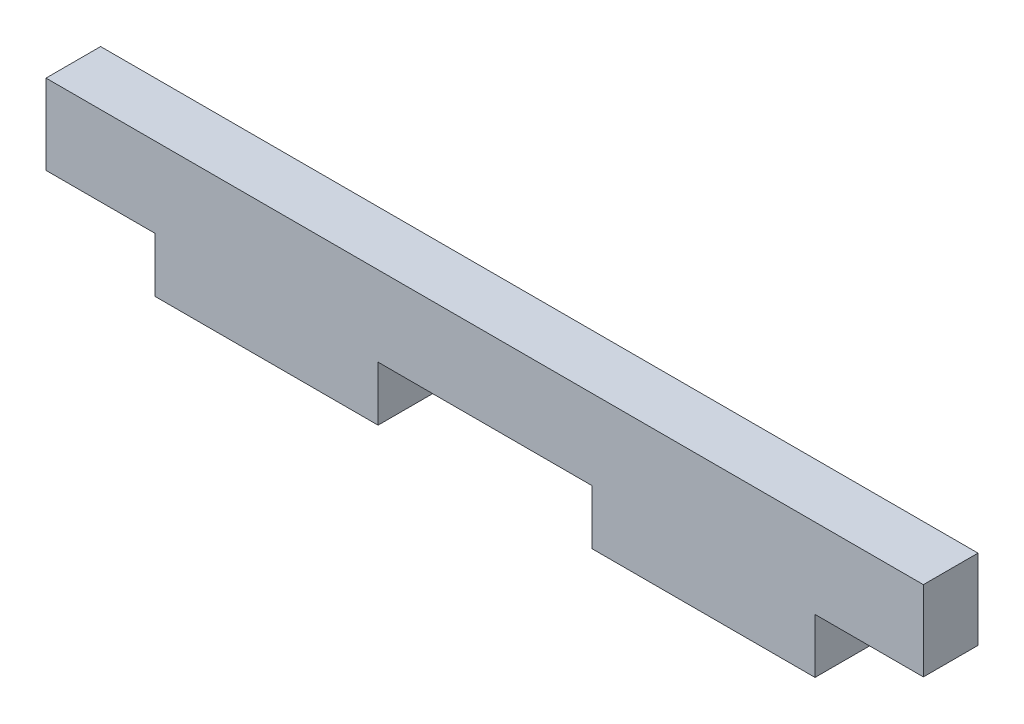
ISO-10303-21;
HEADER;
FILE_DESCRIPTION(('STEP AP214'),'2;1');
FILE_NAME('part.step','',(''),(''),'','','');
FILE_SCHEMA(('AUTOMOTIVE_DESIGN { 1 0 10303 214 1 1 1 1 }'));
ENDSEC;
DATA;
#1=APPLICATION_CONTEXT('core data for automotive mechanical design processes');
#2=APPLICATION_PROTOCOL_DEFINITION('international standard','automotive_design',2000,#1);
#3=PRODUCT_CONTEXT('',#1,'mechanical');
#4=PRODUCT('Part','Part','',(#3));
#5=PRODUCT_RELATED_PRODUCT_CATEGORY('part','',(#4));
#6=PRODUCT_DEFINITION_FORMATION('','',#4);
#7=PRODUCT_DEFINITION_CONTEXT('part definition',#1,'design');
#8=PRODUCT_DEFINITION('design','',#6,#7);
#9=PRODUCT_DEFINITION_SHAPE('','',#8);
#10=(LENGTH_UNIT() NAMED_UNIT(*) SI_UNIT(.MILLI.,.METRE.));
#11=(NAMED_UNIT(*) PLANE_ANGLE_UNIT() SI_UNIT($,.RADIAN.));
#12=(NAMED_UNIT(*) SI_UNIT($,.STERADIAN.) SOLID_ANGLE_UNIT());
#13=UNCERTAINTY_MEASURE_WITH_UNIT(LENGTH_MEASURE(1.E-05),#10,'distance_accuracy_value','');
#14=(GEOMETRIC_REPRESENTATION_CONTEXT(3) GLOBAL_UNCERTAINTY_ASSIGNED_CONTEXT((#13)) GLOBAL_UNIT_ASSIGNED_CONTEXT((#10,
#11,#12)) REPRESENTATION_CONTEXT('',''));
#15=CARTESIAN_POINT('',(0.,0.,0.));
#16=DIRECTION('',(0.,0.,1.));
#17=DIRECTION('',(1.,0.,0.));
#18=AXIS2_PLACEMENT_3D('',#15,#16,#17);
#19=CARTESIAN_POINT('',(19.2024,-3.91159999999998,3.175));
#20=DIRECTION('',(-1.,0.,0.));
#21=DIRECTION('',(0.,0.,1.));
#22=AXIS2_PLACEMENT_3D('',#19,#20,#21);
#23=PLANE('',#22);
#24=DIRECTION('',(0.,1.,0.));
#25=VECTOR('',#24,1.);
#26=CARTESIAN_POINT('',(19.2024,-3.91159999999998,0.));
#27=LINE('',#26,#25);
#28=CARTESIAN_POINT('',(19.2024,-3.91159999999998,0.));
#29=VERTEX_POINT('',#28);
#30=CARTESIAN_POINT('',(19.2024,-0.736600000000013,0.));
#31=VERTEX_POINT('',#30);
#32=EDGE_CURVE('E164',#29,#31,#27,.T.);
#33=ORIENTED_EDGE('',*,*,#32,.T.);
#34=DIRECTION('',(0.,0.,-1.));
#35=VECTOR('',#34,1.);
#36=CARTESIAN_POINT('',(19.2024,-0.736600000000013,3.175));
#37=LINE('',#36,#35);
#38=CARTESIAN_POINT('',(19.2024,-0.736600000000013,3.175));
#39=VERTEX_POINT('',#38);
#40=EDGE_CURVE('E11',#39,#31,#37,.T.);
#41=ORIENTED_EDGE('',*,*,#40,.F.);
#42=DIRECTION('',(0.,1.,0.));
#43=VECTOR('',#42,1.);
#44=CARTESIAN_POINT('',(19.2024,-3.91159999999998,3.175));
#45=LINE('',#44,#43);
#46=CARTESIAN_POINT('',(19.2024,-3.91159999999998,3.175));
#47=VERTEX_POINT('',#46);
#48=EDGE_CURVE('E198',#47,#39,#45,.T.);
#49=ORIENTED_EDGE('',*,*,#48,.F.);
#50=DIRECTION('',(0.,0.,-1.));
#51=VECTOR('',#50,1.);
#52=CARTESIAN_POINT('',(19.2024,-3.91159999999998,3.175));
#53=LINE('',#52,#51);
#54=EDGE_CURVE('E160',#47,#29,#53,.T.);
#55=ORIENTED_EDGE('',*,*,#54,.T.);
#56=EDGE_LOOP('',(#33,#41,#49,#55));
#57=FACE_BOUND('',#56,.T.);
#58=ADVANCED_FACE('F39',(#57),#23,.F.);
#59=CARTESIAN_POINT('',(19.2024,-0.736600000000013,3.175));
#60=DIRECTION('',(0.,1.,0.));
#61=DIRECTION('',(-1.,0.,0.));
#62=AXIS2_PLACEMENT_3D('',#59,#60,#61);
#63=PLANE('',#62);
#64=DIRECTION('',(1.,0.,0.));
#65=VECTOR('',#64,1.);
#66=CARTESIAN_POINT('',(19.2024,-0.736600000000013,0.));
#67=LINE('',#66,#65);
#68=CARTESIAN_POINT('',(25.5016,-0.736600000000015,0.));
#69=VERTEX_POINT('',#68);
#70=EDGE_CURVE('E168',#31,#69,#67,.T.);
#71=ORIENTED_EDGE('',*,*,#70,.T.);
#72=DIRECTION('',(0.,0.,-1.));
#73=VECTOR('',#72,1.);
#74=CARTESIAN_POINT('',(25.5016,-0.736600000000015,3.175));
#75=LINE('',#74,#73);
#76=CARTESIAN_POINT('',(25.5016,-0.736600000000015,3.175));
#77=VERTEX_POINT('',#76);
#78=EDGE_CURVE('E48',#77,#69,#75,.T.);
#79=ORIENTED_EDGE('',*,*,#78,.F.);
#80=DIRECTION('',(1.,0.,0.));
#81=VECTOR('',#80,1.);
#82=CARTESIAN_POINT('',(19.2024,-0.736600000000013,3.175));
#83=LINE('',#82,#81);
#84=EDGE_CURVE('E111',#39,#77,#83,.T.);
#85=ORIENTED_EDGE('',*,*,#84,.F.);
#86=ORIENTED_EDGE('',*,*,#40,.T.);
#87=EDGE_LOOP('',(#71,#79,#85,#86));
#88=FACE_BOUND('',#87,.T.);
#89=ADVANCED_FACE('F292',(#88),#63,.F.);
#90=CARTESIAN_POINT('',(25.5016,-0.736600000000015,3.175));
#91=DIRECTION('',(-1.,0.,0.));
#92=DIRECTION('',(0.,0.,1.));
#93=AXIS2_PLACEMENT_3D('',#90,#91,#92);
#94=PLANE('',#93);
#95=DIRECTION('',(0.,1.,0.));
#96=VECTOR('',#95,1.);
#97=CARTESIAN_POINT('',(25.5016,-0.736600000000015,0.));
#98=LINE('',#97,#96);
#99=CARTESIAN_POINT('',(25.5016,3.91159999999998,0.));
#100=VERTEX_POINT('',#99);
#101=EDGE_CURVE('E171',#69,#100,#98,.T.);
#102=ORIENTED_EDGE('',*,*,#101,.T.);
#103=DIRECTION('',(0.,0.,-1.));
#104=VECTOR('',#103,1.);
#105=CARTESIAN_POINT('',(25.5016,3.91159999999998,3.175));
#106=LINE('',#105,#104);
#107=CARTESIAN_POINT('',(25.5016,3.91159999999998,3.175));
#108=VERTEX_POINT('',#107);
#109=EDGE_CURVE('E225',#108,#100,#106,.T.);
#110=ORIENTED_EDGE('',*,*,#109,.F.);
#111=DIRECTION('',(0.,1.,0.));
#112=VECTOR('',#111,1.);
#113=CARTESIAN_POINT('',(25.5016,-0.736600000000015,3.175));
#114=LINE('',#113,#112);
#115=EDGE_CURVE('E235',#77,#108,#114,.T.);
#116=ORIENTED_EDGE('',*,*,#115,.F.);
#117=ORIENTED_EDGE('',*,*,#78,.T.);
#118=EDGE_LOOP('',(#102,#110,#116,#117));
#119=FACE_BOUND('',#118,.T.);
#120=ADVANCED_FACE('F233',(#119),#94,.F.);
#121=CARTESIAN_POINT('',(25.5016,3.91159999999998,3.175));
#122=DIRECTION('',(0.,-1.,0.));
#123=DIRECTION('',(0.,0.,-1.));
#124=AXIS2_PLACEMENT_3D('',#121,#122,#123);
#125=PLANE('',#124);
#126=DIRECTION('',(-1.,0.,0.));
#127=VECTOR('',#126,1.);
#128=CARTESIAN_POINT('',(25.5016,3.91159999999998,0.));
#129=LINE('',#128,#127);
#130=CARTESIAN_POINT('',(-25.5016,3.91159999999998,0.));
#131=VERTEX_POINT('',#130);
#132=EDGE_CURVE('E174',#100,#131,#129,.T.);
#133=ORIENTED_EDGE('',*,*,#132,.T.);
#134=DIRECTION('',(0.,0.,-1.));
#135=VECTOR('',#134,1.);
#136=CARTESIAN_POINT('',(-25.5016,3.91159999999998,3.175));
#137=LINE('',#136,#135);
#138=CARTESIAN_POINT('',(-25.5016,3.91159999999998,3.175));
#139=VERTEX_POINT('',#138);
#140=EDGE_CURVE('E221',#139,#131,#137,.T.);
#141=ORIENTED_EDGE('',*,*,#140,.F.);
#142=DIRECTION('',(-1.,0.,0.));
#143=VECTOR('',#142,1.);
#144=CARTESIAN_POINT('',(25.5016,3.91159999999998,3.175));
#145=LINE('',#144,#143);
#146=EDGE_CURVE('E254',#108,#139,#145,.T.);
#147=ORIENTED_EDGE('',*,*,#146,.F.);
#148=ORIENTED_EDGE('',*,*,#109,.T.);
#149=EDGE_LOOP('',(#133,#141,#147,#148));
#150=FACE_BOUND('',#149,.T.);
#151=ADVANCED_FACE('F244',(#150),#125,.F.);
#152=CARTESIAN_POINT('',(-25.5016,3.91159999999998,3.175));
#153=DIRECTION('',(1.,0.,0.));
#154=DIRECTION('',(0.,0.,-1.));
#155=AXIS2_PLACEMENT_3D('',#152,#153,#154);
#156=PLANE('',#155);
#157=DIRECTION('',(0.,-1.,0.));
#158=VECTOR('',#157,1.);
#159=CARTESIAN_POINT('',(-25.5016,3.91159999999998,0.));
#160=LINE('',#159,#158);
#161=CARTESIAN_POINT('',(-25.5016,-0.736600000000015,0.));
#162=VERTEX_POINT('',#161);
#163=EDGE_CURVE('E177',#131,#162,#160,.T.);
#164=ORIENTED_EDGE('',*,*,#163,.T.);
#165=DIRECTION('',(0.,0.,-1.));
#166=VECTOR('',#165,1.);
#167=CARTESIAN_POINT('',(-25.5016,-0.736600000000015,3.175));
#168=LINE('',#167,#166);
#169=CARTESIAN_POINT('',(-25.5016,-0.736600000000015,3.175));
#170=VERTEX_POINT('',#169);
#171=EDGE_CURVE('E217',#170,#162,#168,.T.);
#172=ORIENTED_EDGE('',*,*,#171,.F.);
#173=DIRECTION('',(0.,-1.,0.));
#174=VECTOR('',#173,1.);
#175=CARTESIAN_POINT('',(-25.5016,3.91159999999998,3.175));
#176=LINE('',#175,#174);
#177=EDGE_CURVE('E250',#139,#170,#176,.T.);
#178=ORIENTED_EDGE('',*,*,#177,.F.);
#179=ORIENTED_EDGE('',*,*,#140,.T.);
#180=EDGE_LOOP('',(#164,#172,#178,#179));
#181=FACE_BOUND('',#180,.T.);
#182=ADVANCED_FACE('F248',(#181),#156,.F.);
#183=CARTESIAN_POINT('',(-25.5016,-0.736600000000015,3.175));
#184=DIRECTION('',(0.,1.,0.));
#185=DIRECTION('',(-1.,0.,0.));
#186=AXIS2_PLACEMENT_3D('',#183,#184,#185);
#187=PLANE('',#186);
#188=DIRECTION('',(1.,0.,0.));
#189=VECTOR('',#188,1.);
#190=CARTESIAN_POINT('',(-25.5016,-0.736600000000015,0.));
#191=LINE('',#190,#189);
#192=CARTESIAN_POINT('',(-19.1516,-0.736600000000015,0.));
#193=VERTEX_POINT('',#192);
#194=EDGE_CURVE('E180',#162,#193,#191,.T.);
#195=ORIENTED_EDGE('',*,*,#194,.T.);
#196=DIRECTION('',(0.,0.,-1.));
#197=VECTOR('',#196,1.);
#198=CARTESIAN_POINT('',(-19.1516,-0.736600000000015,3.175));
#199=LINE('',#198,#197);
#200=CARTESIAN_POINT('',(-19.1516,-0.736600000000015,3.175));
#201=VERTEX_POINT('',#200);
#202=EDGE_CURVE('E213',#201,#193,#199,.T.);
#203=ORIENTED_EDGE('',*,*,#202,.F.);
#204=DIRECTION('',(1.,0.,0.));
#205=VECTOR('',#204,1.);
#206=CARTESIAN_POINT('',(-25.5016,-0.736600000000015,3.175));
#207=LINE('',#206,#205);
#208=EDGE_CURVE('E253',#170,#201,#207,.T.);
#209=ORIENTED_EDGE('',*,*,#208,.F.);
#210=ORIENTED_EDGE('',*,*,#171,.T.);
#211=EDGE_LOOP('',(#195,#203,#209,#210));
#212=FACE_BOUND('',#211,.T.);
#213=ADVANCED_FACE('F305',(#212),#187,.F.);
#214=CARTESIAN_POINT('',(-19.1516,-0.736600000000015,3.175));
#215=DIRECTION('',(1.,0.,0.));
#216=DIRECTION('',(0.,0.,-1.));
#217=AXIS2_PLACEMENT_3D('',#214,#215,#216);
#218=PLANE('',#217);
#219=DIRECTION('',(0.,-1.,0.));
#220=VECTOR('',#219,1.);
#221=CARTESIAN_POINT('',(-19.1516,-0.736600000000015,0.));
#222=LINE('',#221,#220);
#223=CARTESIAN_POINT('',(-19.1516,-3.91159999999998,0.));
#224=VERTEX_POINT('',#223);
#225=EDGE_CURVE('E183',#193,#224,#222,.T.);
#226=ORIENTED_EDGE('',*,*,#225,.T.);
#227=DIRECTION('',(0.,0.,-1.));
#228=VECTOR('',#227,1.);
#229=CARTESIAN_POINT('',(-19.1516,-3.91159999999998,3.175));
#230=LINE('',#229,#228);
#231=CARTESIAN_POINT('',(-19.1516,-3.91159999999998,3.175));
#232=VERTEX_POINT('',#231);
#233=EDGE_CURVE('E209',#232,#224,#230,.T.);
#234=ORIENTED_EDGE('',*,*,#233,.F.);
#235=DIRECTION('',(0.,-1.,0.));
#236=VECTOR('',#235,1.);
#237=CARTESIAN_POINT('',(-19.1516,-0.736600000000015,3.175));
#238=LINE('',#237,#236);
#239=EDGE_CURVE('E258',#201,#232,#238,.T.);
#240=ORIENTED_EDGE('',*,*,#239,.F.);
#241=ORIENTED_EDGE('',*,*,#202,.T.);
#242=EDGE_LOOP('',(#226,#234,#240,#241));
#243=FACE_BOUND('',#242,.T.);
#244=ADVANCED_FACE('F308',(#243),#218,.F.);
#245=CARTESIAN_POINT('',(-19.1516,-3.91159999999998,3.175));
#246=DIRECTION('',(0.,1.,0.));
#247=DIRECTION('',(-1.,0.,0.));
#248=AXIS2_PLACEMENT_3D('',#245,#246,#247);
#249=PLANE('',#248);
#250=DIRECTION('',(1.,0.,0.));
#251=VECTOR('',#250,1.);
#252=CARTESIAN_POINT('',(-19.1516,-3.91159999999998,0.));
#253=LINE('',#252,#251);
#254=CARTESIAN_POINT('',(-6.19759999999999,-3.91159999999998,0.));
#255=VERTEX_POINT('',#254);
#256=EDGE_CURVE('E186',#224,#255,#253,.T.);
#257=ORIENTED_EDGE('',*,*,#256,.T.);
#258=DIRECTION('',(0.,0.,-1.));
#259=VECTOR('',#258,1.);
#260=CARTESIAN_POINT('',(-6.19759999999999,-3.91159999999998,3.175));
#261=LINE('',#260,#259);
#262=CARTESIAN_POINT('',(-6.19759999999999,-3.91159999999998,3.175));
#263=VERTEX_POINT('',#262);
#264=EDGE_CURVE('E205',#263,#255,#261,.T.);
#265=ORIENTED_EDGE('',*,*,#264,.F.);
#266=DIRECTION('',(1.,0.,0.));
#267=VECTOR('',#266,1.);
#268=CARTESIAN_POINT('',(-19.1516,-3.91159999999998,3.175));
#269=LINE('',#268,#267);
#270=EDGE_CURVE('E265',#232,#263,#269,.T.);
#271=ORIENTED_EDGE('',*,*,#270,.F.);
#272=ORIENTED_EDGE('',*,*,#233,.T.);
#273=EDGE_LOOP('',(#257,#265,#271,#272));
#274=FACE_BOUND('',#273,.T.);
#275=ADVANCED_FACE('F273',(#274),#249,.F.);
#276=CARTESIAN_POINT('',(-6.19759999999999,-3.91159999999998,3.175));
#277=DIRECTION('',(-1.,0.,0.));
#278=DIRECTION('',(0.,-1.,0.));
#279=AXIS2_PLACEMENT_3D('',#276,#277,#278);
#280=PLANE('',#279);
#281=DIRECTION('',(0.,1.,0.));
#282=VECTOR('',#281,1.);
#283=CARTESIAN_POINT('',(-6.19759999999999,-3.91159999999998,0.));
#284=LINE('',#283,#282);
#285=CARTESIAN_POINT('',(-6.1976,-0.736600000000011,0.));
#286=VERTEX_POINT('',#285);
#287=EDGE_CURVE('E189',#255,#286,#284,.T.);
#288=ORIENTED_EDGE('',*,*,#287,.T.);
#289=DIRECTION('',(0.,0.,-1.));
#290=VECTOR('',#289,1.);
#291=CARTESIAN_POINT('',(-6.1976,-0.736600000000011,3.175));
#292=LINE('',#291,#290);
#293=CARTESIAN_POINT('',(-6.1976,-0.736600000000011,3.175));
#294=VERTEX_POINT('',#293);
#295=EDGE_CURVE('E153',#294,#286,#292,.T.);
#296=ORIENTED_EDGE('',*,*,#295,.F.);
#297=DIRECTION('',(0.,1.,0.));
#298=VECTOR('',#297,1.);
#299=CARTESIAN_POINT('',(-6.19759999999999,-3.91159999999998,3.175));
#300=LINE('',#299,#298);
#301=EDGE_CURVE('E142',#263,#294,#300,.T.);
#302=ORIENTED_EDGE('',*,*,#301,.F.);
#303=ORIENTED_EDGE('',*,*,#264,.T.);
#304=EDGE_LOOP('',(#288,#296,#302,#303));
#305=FACE_BOUND('',#304,.T.);
#306=ADVANCED_FACE('F277',(#305),#280,.F.);
#307=CARTESIAN_POINT('',(-6.1976,-0.736600000000011,3.175));
#308=DIRECTION('',(0.,1.,0.));
#309=DIRECTION('',(-1.,0.,0.));
#310=AXIS2_PLACEMENT_3D('',#307,#308,#309);
#311=PLANE('',#310);
#312=DIRECTION('',(1.,0.,0.));
#313=VECTOR('',#312,1.);
#314=CARTESIAN_POINT('',(-6.1976,-0.736600000000011,0.));
#315=LINE('',#314,#313);
#316=CARTESIAN_POINT('',(6.2484,-0.736600000000015,0.));
#317=VERTEX_POINT('',#316);
#318=EDGE_CURVE('E151',#286,#317,#315,.T.);
#319=ORIENTED_EDGE('',*,*,#318,.T.);
#320=DIRECTION('',(0.,0.,-1.));
#321=VECTOR('',#320,1.);
#322=CARTESIAN_POINT('',(6.2484,-0.736600000000015,3.175));
#323=LINE('',#322,#321);
#324=CARTESIAN_POINT('',(6.2484,-0.736600000000015,3.175));
#325=VERTEX_POINT('',#324);
#326=EDGE_CURVE('E148',#325,#317,#323,.T.);
#327=ORIENTED_EDGE('',*,*,#326,.F.);
#328=DIRECTION('',(1.,0.,0.));
#329=VECTOR('',#328,1.);
#330=CARTESIAN_POINT('',(-6.1976,-0.736600000000011,3.175));
#331=LINE('',#330,#329);
#332=EDGE_CURVE('E136',#294,#325,#331,.T.);
#333=ORIENTED_EDGE('',*,*,#332,.F.);
#334=ORIENTED_EDGE('',*,*,#295,.T.);
#335=EDGE_LOOP('',(#319,#327,#333,#334));
#336=FACE_BOUND('',#335,.T.);
#337=ADVANCED_FACE('F149',(#336),#311,.F.);
#338=CARTESIAN_POINT('',(6.2484,-0.736600000000015,3.175));
#339=DIRECTION('',(1.,0.,0.));
#340=DIRECTION('',(0.,0.,-1.));
#341=AXIS2_PLACEMENT_3D('',#338,#339,#340);
#342=PLANE('',#341);
#343=DIRECTION('',(0.,-1.,0.));
#344=VECTOR('',#343,1.);
#345=CARTESIAN_POINT('',(6.2484,-0.736600000000015,0.));
#346=LINE('',#345,#344);
#347=CARTESIAN_POINT('',(6.2484,-3.91159999999998,0.));
#348=VERTEX_POINT('',#347);
#349=EDGE_CURVE('E97',#317,#348,#346,.T.);
#350=ORIENTED_EDGE('',*,*,#349,.T.);
#351=DIRECTION('',(0.,0.,-1.));
#352=VECTOR('',#351,1.);
#353=CARTESIAN_POINT('',(6.2484,-3.91159999999998,3.175));
#354=LINE('',#353,#352);
#355=CARTESIAN_POINT('',(6.2484,-3.91159999999998,3.175));
#356=VERTEX_POINT('',#355);
#357=EDGE_CURVE('E154',#356,#348,#354,.T.);
#358=ORIENTED_EDGE('',*,*,#357,.F.);
#359=DIRECTION('',(0.,-1.,0.));
#360=VECTOR('',#359,1.);
#361=CARTESIAN_POINT('',(6.2484,-0.736600000000015,3.175));
#362=LINE('',#361,#360);
#363=EDGE_CURVE('E140',#325,#356,#362,.T.);
#364=ORIENTED_EDGE('',*,*,#363,.F.);
#365=ORIENTED_EDGE('',*,*,#326,.T.);
#366=EDGE_LOOP('',(#350,#358,#364,#365));
#367=FACE_BOUND('',#366,.T.);
#368=ADVANCED_FACE('F156',(#367),#342,.F.);
#369=CARTESIAN_POINT('',(6.2484,-3.91159999999998,3.175));
#370=DIRECTION('',(0.,1.,0.));
#371=DIRECTION('',(-1.,0.,0.));
#372=AXIS2_PLACEMENT_3D('',#369,#370,#371);
#373=PLANE('',#372);
#374=DIRECTION('',(1.,0.,0.));
#375=VECTOR('',#374,1.);
#376=CARTESIAN_POINT('',(6.2484,-3.91159999999998,0.));
#377=LINE('',#376,#375);
#378=EDGE_CURVE('E103',#348,#29,#377,.T.);
#379=ORIENTED_EDGE('',*,*,#378,.T.);
#380=ORIENTED_EDGE('',*,*,#54,.F.);
#381=DIRECTION('',(1.,0.,0.));
#382=VECTOR('',#381,1.);
#383=CARTESIAN_POINT('',(6.2484,-3.91159999999998,3.175));
#384=LINE('',#383,#382);
#385=EDGE_CURVE('E56',#356,#47,#384,.T.);
#386=ORIENTED_EDGE('',*,*,#385,.F.);
#387=ORIENTED_EDGE('',*,*,#357,.T.);
#388=EDGE_LOOP('',(#379,#380,#386,#387));
#389=FACE_BOUND('',#388,.T.);
#390=ADVANCED_FACE('F281',(#389),#373,.F.);
#391=CARTESIAN_POINT('',(0.,0.,3.175));
#392=DIRECTION('',(0.,0.,-1.));
#393=DIRECTION('',(-1.,0.,0.));
#394=AXIS2_PLACEMENT_3D('',#391,#392,#393);
#395=PLANE('',#394);
#396=ORIENTED_EDGE('',*,*,#48,.T.);
#397=ORIENTED_EDGE('',*,*,#84,.T.);
#398=ORIENTED_EDGE('',*,*,#115,.T.);
#399=ORIENTED_EDGE('',*,*,#146,.T.);
#400=ORIENTED_EDGE('',*,*,#177,.T.);
#401=ORIENTED_EDGE('',*,*,#208,.T.);
#402=ORIENTED_EDGE('',*,*,#239,.T.);
#403=ORIENTED_EDGE('',*,*,#270,.T.);
#404=ORIENTED_EDGE('',*,*,#301,.T.);
#405=ORIENTED_EDGE('',*,*,#332,.T.);
#406=ORIENTED_EDGE('',*,*,#363,.T.);
#407=ORIENTED_EDGE('',*,*,#385,.T.);
#408=EDGE_LOOP('',(#396,#397,#398,#399,#400,#401,#402,#403,#404,#405,#406,#407));
#409=FACE_BOUND('',#408,.T.);
#410=ADVANCED_FACE('F138',(#409),#395,.F.);
#411=CARTESIAN_POINT('',(0.,0.,0.));
#412=DIRECTION('',(0.,0.,-1.));
#413=DIRECTION('',(-1.,0.,0.));
#414=AXIS2_PLACEMENT_3D('',#411,#412,#413);
#415=PLANE('',#414);
#416=ORIENTED_EDGE('',*,*,#32,.F.);
#417=ORIENTED_EDGE('',*,*,#378,.F.);
#418=ORIENTED_EDGE('',*,*,#349,.F.);
#419=ORIENTED_EDGE('',*,*,#318,.F.);
#420=ORIENTED_EDGE('',*,*,#287,.F.);
#421=ORIENTED_EDGE('',*,*,#256,.F.);
#422=ORIENTED_EDGE('',*,*,#225,.F.);
#423=ORIENTED_EDGE('',*,*,#194,.F.);
#424=ORIENTED_EDGE('',*,*,#163,.F.);
#425=ORIENTED_EDGE('',*,*,#132,.F.);
#426=ORIENTED_EDGE('',*,*,#101,.F.);
#427=ORIENTED_EDGE('',*,*,#70,.F.);
#428=EDGE_LOOP('',(#416,#417,#418,#419,#420,#421,#422,#423,#424,#425,#426,#427));
#429=FACE_BOUND('',#428,.T.);
#430=ADVANCED_FACE('F239',(#429),#415,.T.);
#431=CLOSED_SHELL('',(#58,#89,#120,#151,#182,#213,#244,#275,#306,#337,#368,#390,#410,#430));
#432=MANIFOLD_SOLID_BREP('B2',#431);
#433=ADVANCED_BREP_SHAPE_REPRESENTATION('',(#18,#432),#14);
#434=SHAPE_DEFINITION_REPRESENTATION(#9,#433);
ENDSEC;
END-ISO-10303-21;
